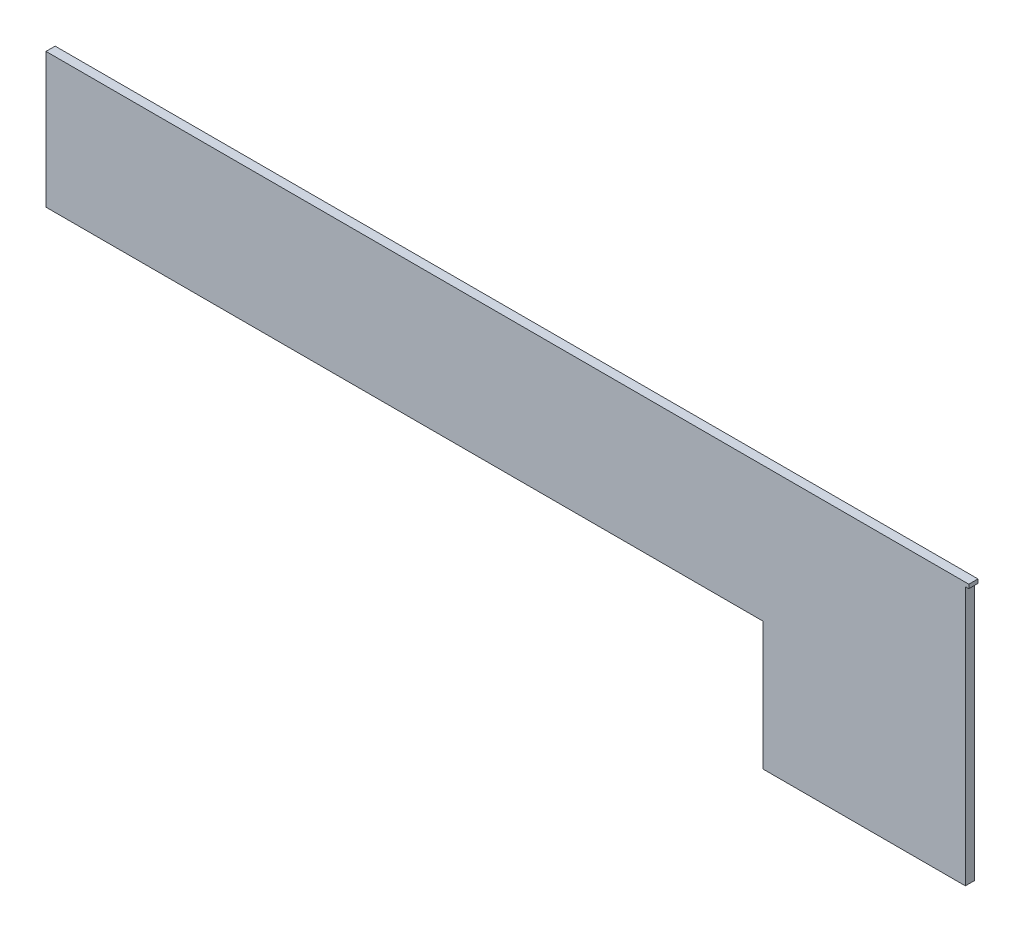
ISO-10303-21;
HEADER;
FILE_DESCRIPTION(('STEP AP214'),'2;1');
FILE_NAME('part.step','',(''),(''),'','','');
FILE_SCHEMA(('AUTOMOTIVE_DESIGN { 1 0 10303 214 1 1 1 1 }'));
ENDSEC;
DATA;
#1=APPLICATION_CONTEXT('core data for automotive mechanical design processes');
#2=APPLICATION_PROTOCOL_DEFINITION('international standard','automotive_design',2000,#1);
#3=PRODUCT_CONTEXT('',#1,'mechanical');
#4=PRODUCT('Part','Part','',(#3));
#5=PRODUCT_RELATED_PRODUCT_CATEGORY('part','',(#4));
#6=PRODUCT_DEFINITION_FORMATION('','',#4);
#7=PRODUCT_DEFINITION_CONTEXT('part definition',#1,'design');
#8=PRODUCT_DEFINITION('design','',#6,#7);
#9=PRODUCT_DEFINITION_SHAPE('','',#8);
#10=(LENGTH_UNIT() NAMED_UNIT(*) SI_UNIT(.MILLI.,.METRE.));
#11=(NAMED_UNIT(*) PLANE_ANGLE_UNIT() SI_UNIT($,.RADIAN.));
#12=(NAMED_UNIT(*) SI_UNIT($,.STERADIAN.) SOLID_ANGLE_UNIT());
#13=UNCERTAINTY_MEASURE_WITH_UNIT(LENGTH_MEASURE(1.E-05),#10,'distance_accuracy_value','');
#14=(GEOMETRIC_REPRESENTATION_CONTEXT(3) GLOBAL_UNCERTAINTY_ASSIGNED_CONTEXT((#13)) GLOBAL_UNIT_ASSIGNED_CONTEXT((#10,
#11,#12)) REPRESENTATION_CONTEXT('',''));
#15=CARTESIAN_POINT('',(0.,0.,0.));
#16=DIRECTION('',(0.,0.,1.));
#17=DIRECTION('',(1.,0.,0.));
#18=AXIS2_PLACEMENT_3D('',#15,#16,#17);
#19=CARTESIAN_POINT('',(0.,0.,-40.));
#20=DIRECTION('',(-1.,0.,0.));
#21=DIRECTION('',(0.,-1.,0.));
#22=AXIS2_PLACEMENT_3D('',#19,#20,#21);
#23=PLANE('',#22);
#24=DIRECTION('',(0.,0.,1.));
#25=VECTOR('',#24,1.);
#26=CARTESIAN_POINT('',(0.,-573.000000000001,-40.));
#27=LINE('',#26,#25);
#28=CARTESIAN_POINT('',(0.,-573.000000000001,-40.));
#29=VERTEX_POINT('',#28);
#30=CARTESIAN_POINT('',(0.,-573.000000000001,0.));
#31=VERTEX_POINT('',#30);
#32=EDGE_CURVE('E137',#29,#31,#27,.T.);
#33=ORIENTED_EDGE('',*,*,#32,.T.);
#34=DIRECTION('',(0.,-1.,0.));
#35=VECTOR('',#34,1.);
#36=CARTESIAN_POINT('',(0.,0.,0.));
#37=LINE('',#36,#35);
#38=CARTESIAN_POINT('',(0.,17.,0.));
#39=VERTEX_POINT('',#38);
#40=EDGE_CURVE('E121',#39,#31,#37,.T.);
#41=ORIENTED_EDGE('',*,*,#40,.F.);
#42=DIRECTION('',(0.,0.,1.));
#43=VECTOR('',#42,1.);
#44=CARTESIAN_POINT('',(0.,17.,-40.));
#45=LINE('',#44,#43);
#46=CARTESIAN_POINT('',(0.,17.,-40.));
#47=VERTEX_POINT('',#46);
#48=EDGE_CURVE('E147',#47,#39,#45,.T.);
#49=ORIENTED_EDGE('',*,*,#48,.F.);
#50=DIRECTION('',(0.,-1.,0.));
#51=VECTOR('',#50,1.);
#52=CARTESIAN_POINT('',(0.,0.,-40.));
#53=LINE('',#52,#51);
#54=EDGE_CURVE('E125',#47,#29,#53,.T.);
#55=ORIENTED_EDGE('',*,*,#54,.T.);
#56=EDGE_LOOP('',(#33,#41,#49,#55));
#57=FACE_BOUND('',#56,.T.);
#58=ADVANCED_FACE('F38',(#57),#23,.T.);
#59=CARTESIAN_POINT('',(0.,0.,-40.));
#60=DIRECTION('',(0.,0.,1.));
#61=DIRECTION('',(1.,0.,0.));
#62=AXIS2_PLACEMENT_3D('',#59,#60,#61);
#63=PLANE('',#62);
#64=DIRECTION('',(0.,1.,0.));
#65=VECTOR('',#64,1.);
#66=CARTESIAN_POINT('',(4020.,0.,-40.));
#67=LINE('',#66,#65);
#68=CARTESIAN_POINT('',(4020.,-1133.,-40.));
#69=VERTEX_POINT('',#68);
#70=CARTESIAN_POINT('',(4020.,0.,-40.));
#71=VERTEX_POINT('',#70);
#72=EDGE_CURVE('E115',#69,#71,#67,.T.);
#73=ORIENTED_EDGE('',*,*,#72,.F.);
#74=DIRECTION('',(-1.,0.,0.));
#75=VECTOR('',#74,1.);
#76=CARTESIAN_POINT('',(3135.,-1133.,-40.));
#77=LINE('',#76,#75);
#78=CARTESIAN_POINT('',(3135.,-1133.,-40.));
#79=VERTEX_POINT('',#78);
#80=EDGE_CURVE('E52',#69,#79,#77,.T.);
#81=ORIENTED_EDGE('',*,*,#80,.T.);
#82=DIRECTION('',(0.,1.,0.));
#83=VECTOR('',#82,1.);
#84=CARTESIAN_POINT('',(3135.,-590.,-40.));
#85=LINE('',#84,#83);
#86=CARTESIAN_POINT('',(3135.,-573.,-40.));
#87=VERTEX_POINT('',#86);
#88=EDGE_CURVE('E112',#79,#87,#85,.T.);
#89=ORIENTED_EDGE('',*,*,#88,.T.);
#90=DIRECTION('',(-1.,0.,0.));
#91=VECTOR('',#90,1.);
#92=CARTESIAN_POINT('',(3135.,-573.,-40.));
#93=LINE('',#92,#91);
#94=EDGE_CURVE('E136',#87,#29,#93,.T.);
#95=ORIENTED_EDGE('',*,*,#94,.T.);
#96=ORIENTED_EDGE('',*,*,#54,.F.);
#97=DIRECTION('',(-1.,0.,0.));
#98=VECTOR('',#97,1.);
#99=CARTESIAN_POINT('',(0.,17.,-40.));
#100=LINE('',#99,#98);
#101=CARTESIAN_POINT('',(4035.15856144112,17.,-40.));
#102=VERTEX_POINT('',#101);
#103=EDGE_CURVE('E152',#102,#47,#100,.T.);
#104=ORIENTED_EDGE('',*,*,#103,.F.);
#105=DIRECTION('',(0.,1.,0.));
#106=VECTOR('',#105,1.);
#107=CARTESIAN_POINT('',(4035.15856144112,0.,-40.));
#108=LINE('',#107,#106);
#109=CARTESIAN_POINT('',(4035.15856144112,0.,-40.));
#110=VERTEX_POINT('',#109);
#111=EDGE_CURVE('E172',#110,#102,#108,.T.);
#112=ORIENTED_EDGE('',*,*,#111,.F.);
#113=DIRECTION('',(1.,0.,0.));
#114=VECTOR('',#113,1.);
#115=CARTESIAN_POINT('',(0.,0.,-40.));
#116=LINE('',#115,#114);
#117=EDGE_CURVE('E167',#71,#110,#116,.T.);
#118=ORIENTED_EDGE('',*,*,#117,.F.);
#119=EDGE_LOOP('',(#73,#81,#89,#95,#96,#104,#112,#118));
#120=FACE_BOUND('',#119,.T.);
#121=ADVANCED_FACE('F110',(#120),#63,.F.);
#122=CARTESIAN_POINT('',(0.,0.,0.));
#123=DIRECTION('',(0.,0.,1.));
#124=DIRECTION('',(1.,0.,0.));
#125=AXIS2_PLACEMENT_3D('',#122,#123,#124);
#126=PLANE('',#125);
#127=DIRECTION('',(-1.,0.,0.));
#128=VECTOR('',#127,1.);
#129=CARTESIAN_POINT('',(0.,-1133.,0.));
#130=LINE('',#129,#128);
#131=CARTESIAN_POINT('',(4020.,-1133.,0.));
#132=VERTEX_POINT('',#131);
#133=CARTESIAN_POINT('',(3135.,-1133.,0.));
#134=VERTEX_POINT('',#133);
#135=EDGE_CURVE('E102',#132,#134,#130,.T.);
#136=ORIENTED_EDGE('',*,*,#135,.F.);
#137=DIRECTION('',(0.,1.,0.));
#138=VECTOR('',#137,1.);
#139=CARTESIAN_POINT('',(4020.,0.,0.));
#140=LINE('',#139,#138);
#141=CARTESIAN_POINT('',(4020.,0.,0.));
#142=VERTEX_POINT('',#141);
#143=EDGE_CURVE('E60',#132,#142,#140,.T.);
#144=ORIENTED_EDGE('',*,*,#143,.T.);
#145=DIRECTION('',(1.,0.,0.));
#146=VECTOR('',#145,1.);
#147=CARTESIAN_POINT('',(0.,0.,0.));
#148=LINE('',#147,#146);
#149=CARTESIAN_POINT('',(4035.15856144112,0.,0.));
#150=VERTEX_POINT('',#149);
#151=EDGE_CURVE('E169',#142,#150,#148,.T.);
#152=ORIENTED_EDGE('',*,*,#151,.T.);
#153=DIRECTION('',(0.,1.,0.));
#154=VECTOR('',#153,1.);
#155=CARTESIAN_POINT('',(4035.15856144112,0.,0.));
#156=LINE('',#155,#154);
#157=CARTESIAN_POINT('',(4035.15856144112,17.,0.));
#158=VERTEX_POINT('',#157);
#159=EDGE_CURVE('E175',#150,#158,#156,.T.);
#160=ORIENTED_EDGE('',*,*,#159,.T.);
#161=DIRECTION('',(-1.,0.,0.));
#162=VECTOR('',#161,1.);
#163=CARTESIAN_POINT('',(0.,17.,0.));
#164=LINE('',#163,#162);
#165=EDGE_CURVE('E143',#158,#39,#164,.T.);
#166=ORIENTED_EDGE('',*,*,#165,.T.);
#167=ORIENTED_EDGE('',*,*,#40,.T.);
#168=DIRECTION('',(-1.,0.,0.));
#169=VECTOR('',#168,1.);
#170=CARTESIAN_POINT('',(0.,-573.000000000001,0.));
#171=LINE('',#170,#169);
#172=CARTESIAN_POINT('',(3135.,-573.,0.));
#173=VERTEX_POINT('',#172);
#174=EDGE_CURVE('E11',#173,#31,#171,.T.);
#175=ORIENTED_EDGE('',*,*,#174,.F.);
#176=DIRECTION('',(0.,1.,0.));
#177=VECTOR('',#176,1.);
#178=CARTESIAN_POINT('',(3135.,0.,0.));
#179=LINE('',#178,#177);
#180=EDGE_CURVE('E45',#134,#173,#179,.T.);
#181=ORIENTED_EDGE('',*,*,#180,.F.);
#182=EDGE_LOOP('',(#136,#144,#152,#160,#166,#167,#175,#181));
#183=FACE_BOUND('',#182,.T.);
#184=ADVANCED_FACE('F139',(#183),#126,.T.);
#185=CARTESIAN_POINT('',(3135.,-590.,-40.));
#186=DIRECTION('',(1.,0.,0.));
#187=DIRECTION('',(0.,0.,-1.));
#188=AXIS2_PLACEMENT_3D('',#185,#186,#187);
#189=PLANE('',#188);
#190=ORIENTED_EDGE('',*,*,#88,.F.);
#191=DIRECTION('',(0.,0.,1.));
#192=VECTOR('',#191,1.);
#193=CARTESIAN_POINT('',(3135.,-1133.,-40.));
#194=LINE('',#193,#192);
#195=EDGE_CURVE('E100',#79,#134,#194,.T.);
#196=ORIENTED_EDGE('',*,*,#195,.T.);
#197=ORIENTED_EDGE('',*,*,#180,.T.);
#198=DIRECTION('',(0.,0.,1.));
#199=VECTOR('',#198,1.);
#200=CARTESIAN_POINT('',(3135.,-573.,-40.));
#201=LINE('',#200,#199);
#202=EDGE_CURVE('E119',#87,#173,#201,.T.);
#203=ORIENTED_EDGE('',*,*,#202,.F.);
#204=EDGE_LOOP('',(#190,#196,#197,#203));
#205=FACE_BOUND('',#204,.T.);
#206=ADVANCED_FACE('F117',(#205),#189,.F.);
#207=CARTESIAN_POINT('',(4020.,0.,-40.));
#208=DIRECTION('',(1.,0.,0.));
#209=DIRECTION('',(0.,0.,-1.));
#210=AXIS2_PLACEMENT_3D('',#207,#208,#209);
#211=PLANE('',#210);
#212=DIRECTION('',(0.,0.,1.));
#213=VECTOR('',#212,1.);
#214=CARTESIAN_POINT('',(4020.,-1133.,-40.));
#215=LINE('',#214,#213);
#216=EDGE_CURVE('E106',#69,#132,#215,.T.);
#217=ORIENTED_EDGE('',*,*,#216,.F.);
#218=ORIENTED_EDGE('',*,*,#72,.T.);
#219=DIRECTION('',(0.,0.,1.));
#220=VECTOR('',#219,1.);
#221=CARTESIAN_POINT('',(4020.,0.,-40.));
#222=LINE('',#221,#220);
#223=EDGE_CURVE('E122',#71,#142,#222,.T.);
#224=ORIENTED_EDGE('',*,*,#223,.T.);
#225=ORIENTED_EDGE('',*,*,#143,.F.);
#226=EDGE_LOOP('',(#217,#218,#224,#225));
#227=FACE_BOUND('',#226,.T.);
#228=ADVANCED_FACE('F164',(#227),#211,.T.);
#229=CARTESIAN_POINT('',(0.,0.,-40.));
#230=DIRECTION('',(0.,-1.,0.));
#231=DIRECTION('',(0.,0.,-1.));
#232=AXIS2_PLACEMENT_3D('',#229,#230,#231);
#233=PLANE('',#232);
#234=ORIENTED_EDGE('',*,*,#223,.F.);
#235=ORIENTED_EDGE('',*,*,#117,.T.);
#236=DIRECTION('',(0.,0.,1.));
#237=VECTOR('',#236,1.);
#238=CARTESIAN_POINT('',(4035.15856144112,0.,-40.));
#239=LINE('',#238,#237);
#240=EDGE_CURVE('E155',#110,#150,#239,.T.);
#241=ORIENTED_EDGE('',*,*,#240,.T.);
#242=ORIENTED_EDGE('',*,*,#151,.F.);
#243=EDGE_LOOP('',(#234,#235,#241,#242));
#244=FACE_BOUND('',#243,.T.);
#245=ADVANCED_FACE('F166',(#244),#233,.T.);
#246=CARTESIAN_POINT('',(0.,17.,-40.));
#247=DIRECTION('',(0.,1.,0.));
#248=DIRECTION('',(0.,0.,1.));
#249=AXIS2_PLACEMENT_3D('',#246,#247,#248);
#250=PLANE('',#249);
#251=ORIENTED_EDGE('',*,*,#165,.F.);
#252=DIRECTION('',(0.,0.,1.));
#253=VECTOR('',#252,1.);
#254=CARTESIAN_POINT('',(4035.15856144112,17.,-40.));
#255=LINE('',#254,#253);
#256=EDGE_CURVE('E153',#102,#158,#255,.T.);
#257=ORIENTED_EDGE('',*,*,#256,.F.);
#258=ORIENTED_EDGE('',*,*,#103,.T.);
#259=ORIENTED_EDGE('',*,*,#48,.T.);
#260=EDGE_LOOP('',(#251,#257,#258,#259));
#261=FACE_BOUND('',#260,.T.);
#262=ADVANCED_FACE('F150',(#261),#250,.T.);
#263=CARTESIAN_POINT('',(4035.15856144112,0.,-40.));
#264=DIRECTION('',(1.,0.,0.));
#265=DIRECTION('',(0.,0.,-1.));
#266=AXIS2_PLACEMENT_3D('',#263,#264,#265);
#267=PLANE('',#266);
#268=ORIENTED_EDGE('',*,*,#159,.F.);
#269=ORIENTED_EDGE('',*,*,#240,.F.);
#270=ORIENTED_EDGE('',*,*,#111,.T.);
#271=ORIENTED_EDGE('',*,*,#256,.T.);
#272=EDGE_LOOP('',(#268,#269,#270,#271));
#273=FACE_BOUND('',#272,.T.);
#274=ADVANCED_FACE('F181',(#273),#267,.T.);
#275=CARTESIAN_POINT('',(3135.,-573.,-40.));
#276=DIRECTION('',(0.,1.,0.));
#277=DIRECTION('',(-1.,0.,0.));
#278=AXIS2_PLACEMENT_3D('',#275,#276,#277);
#279=PLANE('',#278);
#280=ORIENTED_EDGE('',*,*,#174,.T.);
#281=ORIENTED_EDGE('',*,*,#32,.F.);
#282=ORIENTED_EDGE('',*,*,#94,.F.);
#283=ORIENTED_EDGE('',*,*,#202,.T.);
#284=EDGE_LOOP('',(#280,#281,#282,#283));
#285=FACE_BOUND('',#284,.T.);
#286=ADVANCED_FACE('F134',(#285),#279,.F.);
#287=CARTESIAN_POINT('',(3135.,-1133.,-40.));
#288=DIRECTION('',(0.,1.,0.));
#289=DIRECTION('',(0.,0.,1.));
#290=AXIS2_PLACEMENT_3D('',#287,#288,#289);
#291=PLANE('',#290);
#292=ORIENTED_EDGE('',*,*,#135,.T.);
#293=ORIENTED_EDGE('',*,*,#195,.F.);
#294=ORIENTED_EDGE('',*,*,#80,.F.);
#295=ORIENTED_EDGE('',*,*,#216,.T.);
#296=EDGE_LOOP('',(#292,#293,#294,#295));
#297=FACE_BOUND('',#296,.T.);
#298=ADVANCED_FACE('F101',(#297),#291,.F.);
#299=CLOSED_SHELL('',(#58,#121,#184,#206,#228,#245,#262,#274,#286,#298));
#300=MANIFOLD_SOLID_BREP('B2',#299);
#301=ADVANCED_BREP_SHAPE_REPRESENTATION('',(#18,#300),#14);
#302=SHAPE_DEFINITION_REPRESENTATION(#9,#301);
ENDSEC;
END-ISO-10303-21;
